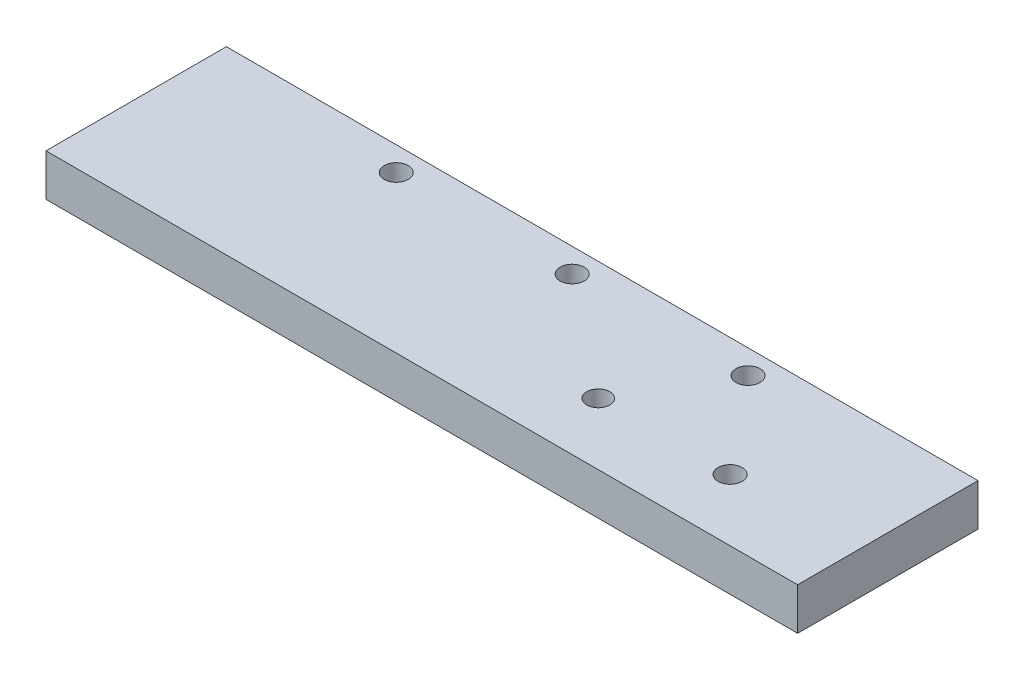
ISO-10303-21;
HEADER;
FILE_DESCRIPTION(('STEP AP214'),'2;1');
FILE_NAME('part.step','',(''),(''),'','','');
FILE_SCHEMA(('AUTOMOTIVE_DESIGN { 1 0 10303 214 1 1 1 1 }'));
ENDSEC;
DATA;
#1=APPLICATION_CONTEXT('core data for automotive mechanical design processes');
#2=APPLICATION_PROTOCOL_DEFINITION('international standard','automotive_design',2000,#1);
#3=PRODUCT_CONTEXT('',#1,'mechanical');
#4=PRODUCT('Part','Part','',(#3));
#5=PRODUCT_RELATED_PRODUCT_CATEGORY('part','',(#4));
#6=PRODUCT_DEFINITION_FORMATION('','',#4);
#7=PRODUCT_DEFINITION_CONTEXT('part definition',#1,'design');
#8=PRODUCT_DEFINITION('design','',#6,#7);
#9=PRODUCT_DEFINITION_SHAPE('','',#8);
#10=(LENGTH_UNIT() NAMED_UNIT(*) SI_UNIT(.MILLI.,.METRE.));
#11=(NAMED_UNIT(*) PLANE_ANGLE_UNIT() SI_UNIT($,.RADIAN.));
#12=(NAMED_UNIT(*) SI_UNIT($,.STERADIAN.) SOLID_ANGLE_UNIT());
#13=UNCERTAINTY_MEASURE_WITH_UNIT(LENGTH_MEASURE(1.E-05),#10,'distance_accuracy_value','');
#14=(GEOMETRIC_REPRESENTATION_CONTEXT(3) GLOBAL_UNCERTAINTY_ASSIGNED_CONTEXT((#13)) GLOBAL_UNIT_ASSIGNED_CONTEXT((#10,
#11,#12)) REPRESENTATION_CONTEXT('',''));
#15=CARTESIAN_POINT('',(0.,0.,0.));
#16=DIRECTION('',(0.,0.,1.));
#17=DIRECTION('',(1.,0.,0.));
#18=AXIS2_PLACEMENT_3D('',#15,#16,#17);
#19=CARTESIAN_POINT('',(-102.510460251046,7.,-65.1673640167364));
#20=DIRECTION('',(0.,0.,-1.));
#21=DIRECTION('',(-1.,0.,0.));
#22=AXIS2_PLACEMENT_3D('',#19,#20,#21);
#23=PLANE('',#22);
#24=DIRECTION('',(1.,0.,0.));
#25=VECTOR('',#24,1.);
#26=CARTESIAN_POINT('',(-102.510460251046,0.,-65.1673640167364));
#27=LINE('',#26,#25);
#28=CARTESIAN_POINT('',(-102.510460251046,0.,-65.1673640167364));
#29=VERTEX_POINT('',#28);
#30=CARTESIAN_POINT('',(22.4895397489539,0.,-65.1673640167364));
#31=VERTEX_POINT('',#30);
#32=EDGE_CURVE('E99',#29,#31,#27,.T.);
#33=ORIENTED_EDGE('',*,*,#32,.F.);
#34=DIRECTION('',(0.,-1.,0.));
#35=VECTOR('',#34,1.);
#36=CARTESIAN_POINT('',(-102.510460251046,7.,-65.1673640167364));
#37=LINE('',#36,#35);
#38=CARTESIAN_POINT('',(-102.510460251046,7.,-65.1673640167364));
#39=VERTEX_POINT('',#38);
#40=EDGE_CURVE('E11',#39,#29,#37,.T.);
#41=ORIENTED_EDGE('',*,*,#40,.F.);
#42=DIRECTION('',(1.,0.,0.));
#43=VECTOR('',#42,1.);
#44=CARTESIAN_POINT('',(-102.510460251046,7.,-65.1673640167364));
#45=LINE('',#44,#43);
#46=CARTESIAN_POINT('',(22.4895397489539,7.,-65.1673640167364));
#47=VERTEX_POINT('',#46);
#48=EDGE_CURVE('E93',#39,#47,#45,.T.);
#49=ORIENTED_EDGE('',*,*,#48,.T.);
#50=DIRECTION('',(0.,-1.,0.));
#51=VECTOR('',#50,1.);
#52=CARTESIAN_POINT('',(22.4895397489539,7.,-65.1673640167364));
#53=LINE('',#52,#51);
#54=EDGE_CURVE('E36',#47,#31,#53,.T.);
#55=ORIENTED_EDGE('',*,*,#54,.T.);
#56=EDGE_LOOP('',(#33,#41,#49,#55));
#57=FACE_BOUND('',#56,.T.);
#58=ADVANCED_FACE('F33',(#57),#23,.T.);
#59=CARTESIAN_POINT('',(-102.510460251046,7.,-65.1673640167364));
#60=DIRECTION('',(1.,0.,0.));
#61=DIRECTION('',(0.,0.,-1.));
#62=AXIS2_PLACEMENT_3D('',#59,#60,#61);
#63=PLANE('',#62);
#64=DIRECTION('',(0.,0.,1.));
#65=VECTOR('',#64,1.);
#66=CARTESIAN_POINT('',(-102.510460251046,0.,-65.1673640167364));
#67=LINE('',#66,#65);
#68=CARTESIAN_POINT('',(-102.510460251046,0.,-35.1673640167364));
#69=VERTEX_POINT('',#68);
#70=EDGE_CURVE('E66',#29,#69,#67,.T.);
#71=ORIENTED_EDGE('',*,*,#70,.T.);
#72=DIRECTION('',(0.,-1.,0.));
#73=VECTOR('',#72,1.);
#74=CARTESIAN_POINT('',(-102.510460251046,7.,-35.1673640167364));
#75=LINE('',#74,#73);
#76=CARTESIAN_POINT('',(-102.510460251046,7.,-35.1673640167364));
#77=VERTEX_POINT('',#76);
#78=EDGE_CURVE('E42',#77,#69,#75,.T.);
#79=ORIENTED_EDGE('',*,*,#78,.F.);
#80=DIRECTION('',(0.,0.,1.));
#81=VECTOR('',#80,1.);
#82=CARTESIAN_POINT('',(-102.510460251046,7.,-65.1673640167364));
#83=LINE('',#82,#81);
#84=EDGE_CURVE('E83',#39,#77,#83,.T.);
#85=ORIENTED_EDGE('',*,*,#84,.F.);
#86=ORIENTED_EDGE('',*,*,#40,.T.);
#87=EDGE_LOOP('',(#71,#79,#85,#86));
#88=FACE_BOUND('',#87,.T.);
#89=ADVANCED_FACE('F110',(#88),#63,.F.);
#90=CARTESIAN_POINT('',(-102.510460251046,7.,-35.1673640167364));
#91=DIRECTION('',(0.,0.,-1.));
#92=DIRECTION('',(-1.,0.,0.));
#93=AXIS2_PLACEMENT_3D('',#90,#91,#92);
#94=PLANE('',#93);
#95=DIRECTION('',(1.,0.,0.));
#96=VECTOR('',#95,1.);
#97=CARTESIAN_POINT('',(-102.510460251046,0.,-35.1673640167364));
#98=LINE('',#97,#96);
#99=CARTESIAN_POINT('',(22.4895397489539,0.,-35.1673640167364));
#100=VERTEX_POINT('',#99);
#101=EDGE_CURVE('E90',#69,#100,#98,.T.);
#102=ORIENTED_EDGE('',*,*,#101,.T.);
#103=DIRECTION('',(0.,-1.,0.));
#104=VECTOR('',#103,1.);
#105=CARTESIAN_POINT('',(22.4895397489539,7.,-35.1673640167364));
#106=LINE('',#105,#104);
#107=CARTESIAN_POINT('',(22.4895397489539,7.,-35.1673640167364));
#108=VERTEX_POINT('',#107);
#109=EDGE_CURVE('E87',#108,#100,#106,.T.);
#110=ORIENTED_EDGE('',*,*,#109,.F.);
#111=DIRECTION('',(1.,0.,0.));
#112=VECTOR('',#111,1.);
#113=CARTESIAN_POINT('',(-102.510460251046,7.,-35.1673640167364));
#114=LINE('',#113,#112);
#115=EDGE_CURVE('E78',#77,#108,#114,.T.);
#116=ORIENTED_EDGE('',*,*,#115,.F.);
#117=ORIENTED_EDGE('',*,*,#78,.T.);
#118=EDGE_LOOP('',(#102,#110,#116,#117));
#119=FACE_BOUND('',#118,.T.);
#120=ADVANCED_FACE('F88',(#119),#94,.F.);
#121=CARTESIAN_POINT('',(22.4895397489539,7.,-65.1673640167364));
#122=DIRECTION('',(1.,0.,0.));
#123=DIRECTION('',(0.,0.,-1.));
#124=AXIS2_PLACEMENT_3D('',#121,#122,#123);
#125=PLANE('',#124);
#126=DIRECTION('',(0.,0.,1.));
#127=VECTOR('',#126,1.);
#128=CARTESIAN_POINT('',(22.4895397489539,0.,-65.1673640167364));
#129=LINE('',#128,#127);
#130=EDGE_CURVE('E102',#31,#100,#129,.T.);
#131=ORIENTED_EDGE('',*,*,#130,.F.);
#132=ORIENTED_EDGE('',*,*,#54,.F.);
#133=DIRECTION('',(0.,0.,1.));
#134=VECTOR('',#133,1.);
#135=CARTESIAN_POINT('',(22.4895397489539,7.,-65.1673640167364));
#136=LINE('',#135,#134);
#137=EDGE_CURVE('E82',#47,#108,#136,.T.);
#138=ORIENTED_EDGE('',*,*,#137,.T.);
#139=ORIENTED_EDGE('',*,*,#109,.T.);
#140=EDGE_LOOP('',(#131,#132,#138,#139));
#141=FACE_BOUND('',#140,.T.);
#142=ADVANCED_FACE('F92',(#141),#125,.T.);
#143=CARTESIAN_POINT('',(0.,7.,0.));
#144=DIRECTION('',(0.,-1.,0.));
#145=DIRECTION('',(0.,0.,-1.));
#146=AXIS2_PLACEMENT_3D('',#143,#144,#145);
#147=PLANE('',#146);
#148=CARTESIAN_POINT('',(-70.2604602510461,7.,-61.1673640167364));
#149=DIRECTION('',(0.,-1.,0.));
#150=DIRECTION('',(0.,0.,-1.));
#151=AXIS2_PLACEMENT_3D('',#148,#149,#150);
#152=CIRCLE('',#151,2.);
#153=CARTESIAN_POINT('',(-70.2604602510461,7.,-63.1673640167364));
#154=VERTEX_POINT('',#153);
#155=EDGE_CURVE('E103',#154,#154,#152,.T.);
#156=ORIENTED_EDGE('',*,*,#155,.T.);
#157=EDGE_LOOP('',(#156));
#158=FACE_BOUND('',#157,.T.);
#159=CARTESIAN_POINT('',(-41.0104602510461,7.,-61.1673640167364));
#160=DIRECTION('',(0.,-1.,0.));
#161=DIRECTION('',(0.,0.,-1.));
#162=AXIS2_PLACEMENT_3D('',#159,#160,#161);
#163=CIRCLE('',#162,2.);
#164=CARTESIAN_POINT('',(-41.0104602510461,7.,-63.1673640167364));
#165=VERTEX_POINT('',#164);
#166=EDGE_CURVE('E159',#165,#165,#163,.T.);
#167=ORIENTED_EDGE('',*,*,#166,.T.);
#168=EDGE_LOOP('',(#167));
#169=FACE_BOUND('',#168,.T.);
#170=CARTESIAN_POINT('',(-11.7604602510461,7.,-61.1673640167364));
#171=DIRECTION('',(0.,-1.,0.));
#172=DIRECTION('',(0.,0.,-1.));
#173=AXIS2_PLACEMENT_3D('',#170,#171,#172);
#174=CIRCLE('',#173,2.00000000000001);
#175=CARTESIAN_POINT('',(-11.7604602510461,7.,-63.1673640167364));
#176=VERTEX_POINT('',#175);
#177=EDGE_CURVE('E161',#176,#176,#174,.T.);
#178=ORIENTED_EDGE('',*,*,#177,.T.);
#179=EDGE_LOOP('',(#178));
#180=FACE_BOUND('',#179,.T.);
#181=CARTESIAN_POINT('',(-20.9296837814463,7.,-45.4353956948097));
#182=DIRECTION('',(0.,-1.,0.));
#183=DIRECTION('',(0.,0.,-1.));
#184=AXIS2_PLACEMENT_3D('',#181,#182,#183);
#185=CIRCLE('',#184,1.91901681708569);
#186=CARTESIAN_POINT('',(-20.9296837814463,7.,-47.3544125118954));
#187=VERTEX_POINT('',#186);
#188=EDGE_CURVE('E166',#187,#187,#185,.T.);
#189=ORIENTED_EDGE('',*,*,#188,.T.);
#190=EDGE_LOOP('',(#189));
#191=FACE_BOUND('',#190,.T.);
#192=CARTESIAN_POINT('',(0.988735890301129,7.,-45.4353956948097));
#193=DIRECTION('',(0.,-1.,0.));
#194=DIRECTION('',(0.,0.,-1.));
#195=AXIS2_PLACEMENT_3D('',#192,#193,#194);
#196=CIRCLE('',#195,2.00548638503668);
#197=CARTESIAN_POINT('',(0.988735890301129,7.,-47.4408820798464));
#198=VERTEX_POINT('',#197);
#199=EDGE_CURVE('E169',#198,#198,#196,.T.);
#200=ORIENTED_EDGE('',*,*,#199,.T.);
#201=EDGE_LOOP('',(#200));
#202=FACE_BOUND('',#201,.T.);
#203=ORIENTED_EDGE('',*,*,#48,.F.);
#204=ORIENTED_EDGE('',*,*,#84,.T.);
#205=ORIENTED_EDGE('',*,*,#115,.T.);
#206=ORIENTED_EDGE('',*,*,#137,.F.);
#207=EDGE_LOOP('',(#203,#204,#205,#206));
#208=FACE_BOUND('',#207,.T.);
#209=ADVANCED_FACE('F81',(#158,#169,#180,#191,#202,#208),#147,.F.);
#210=CARTESIAN_POINT('',(0.,0.,0.));
#211=DIRECTION('',(0.,-1.,0.));
#212=DIRECTION('',(0.,0.,-1.));
#213=AXIS2_PLACEMENT_3D('',#210,#211,#212);
#214=PLANE('',#213);
#215=CARTESIAN_POINT('',(-70.2604602510461,0.,-61.1673640167364));
#216=DIRECTION('',(0.,-1.,0.));
#217=DIRECTION('',(0.,0.,-1.));
#218=AXIS2_PLACEMENT_3D('',#215,#216,#217);
#219=CIRCLE('',#218,2.);
#220=CARTESIAN_POINT('',(-70.2604602510461,0.,-63.1673640167364));
#221=VERTEX_POINT('',#220);
#222=EDGE_CURVE('E157',#221,#221,#219,.T.);
#223=ORIENTED_EDGE('',*,*,#222,.F.);
#224=EDGE_LOOP('',(#223));
#225=FACE_BOUND('',#224,.T.);
#226=CARTESIAN_POINT('',(-41.0104602510461,0.,-61.1673640167364));
#227=DIRECTION('',(0.,-1.,0.));
#228=DIRECTION('',(0.,0.,-1.));
#229=AXIS2_PLACEMENT_3D('',#226,#227,#228);
#230=CIRCLE('',#229,2.);
#231=CARTESIAN_POINT('',(-41.0104602510461,0.,-63.1673640167364));
#232=VERTEX_POINT('',#231);
#233=EDGE_CURVE('E181',#232,#232,#230,.T.);
#234=ORIENTED_EDGE('',*,*,#233,.F.);
#235=EDGE_LOOP('',(#234));
#236=FACE_BOUND('',#235,.T.);
#237=CARTESIAN_POINT('',(-11.7604602510461,0.,-61.1673640167364));
#238=DIRECTION('',(0.,-1.,0.));
#239=DIRECTION('',(0.,0.,-1.));
#240=AXIS2_PLACEMENT_3D('',#237,#238,#239);
#241=CIRCLE('',#240,2.00000000000001);
#242=CARTESIAN_POINT('',(-11.7604602510461,0.,-63.1673640167364));
#243=VERTEX_POINT('',#242);
#244=EDGE_CURVE('E178',#243,#243,#241,.T.);
#245=ORIENTED_EDGE('',*,*,#244,.F.);
#246=EDGE_LOOP('',(#245));
#247=FACE_BOUND('',#246,.T.);
#248=CARTESIAN_POINT('',(-20.9296837814463,0.,-45.4353956948097));
#249=DIRECTION('',(0.,-1.,0.));
#250=DIRECTION('',(0.,0.,-1.));
#251=AXIS2_PLACEMENT_3D('',#248,#249,#250);
#252=CIRCLE('',#251,1.91901681708569);
#253=CARTESIAN_POINT('',(-20.9296837814463,0.,-47.3544125118954));
#254=VERTEX_POINT('',#253);
#255=EDGE_CURVE('E175',#254,#254,#252,.T.);
#256=ORIENTED_EDGE('',*,*,#255,.F.);
#257=EDGE_LOOP('',(#256));
#258=FACE_BOUND('',#257,.T.);
#259=CARTESIAN_POINT('',(0.988735890301129,0.,-45.4353956948097));
#260=DIRECTION('',(0.,-1.,0.));
#261=DIRECTION('',(0.,0.,-1.));
#262=AXIS2_PLACEMENT_3D('',#259,#260,#261);
#263=CIRCLE('',#262,2.00548638503668);
#264=CARTESIAN_POINT('',(0.988735890301129,0.,-47.4408820798464));
#265=VERTEX_POINT('',#264);
#266=EDGE_CURVE('E172',#265,#265,#263,.T.);
#267=ORIENTED_EDGE('',*,*,#266,.F.);
#268=EDGE_LOOP('',(#267));
#269=FACE_BOUND('',#268,.T.);
#270=ORIENTED_EDGE('',*,*,#32,.T.);
#271=ORIENTED_EDGE('',*,*,#130,.T.);
#272=ORIENTED_EDGE('',*,*,#101,.F.);
#273=ORIENTED_EDGE('',*,*,#70,.F.);
#274=EDGE_LOOP('',(#270,#271,#272,#273));
#275=FACE_BOUND('',#274,.T.);
#276=ADVANCED_FACE('F108',(#225,#236,#247,#258,#269,#275),#214,.T.);
#277=CARTESIAN_POINT('',(0.988735890301129,10.,-45.4353956948097));
#278=DIRECTION('',(0.,-1.,0.));
#279=DIRECTION('',(0.,0.,-1.));
#280=AXIS2_PLACEMENT_3D('',#277,#278,#279);
#281=CYLINDRICAL_SURFACE('',#280,2.00548638503668);
#282=ORIENTED_EDGE('',*,*,#266,.T.);
#283=EDGE_LOOP('',(#282));
#284=FACE_BOUND('',#283,.T.);
#285=ORIENTED_EDGE('',*,*,#199,.F.);
#286=EDGE_LOOP('',(#285));
#287=FACE_BOUND('',#286,.T.);
#288=ADVANCED_FACE('F129',(#284,#287),#281,.F.);
#289=CARTESIAN_POINT('',(-20.9296837814463,10.,-45.4353956948097));
#290=DIRECTION('',(0.,-1.,0.));
#291=DIRECTION('',(0.,0.,-1.));
#292=AXIS2_PLACEMENT_3D('',#289,#290,#291);
#293=CYLINDRICAL_SURFACE('',#292,1.91901681708569);
#294=ORIENTED_EDGE('',*,*,#255,.T.);
#295=EDGE_LOOP('',(#294));
#296=FACE_BOUND('',#295,.T.);
#297=ORIENTED_EDGE('',*,*,#188,.F.);
#298=EDGE_LOOP('',(#297));
#299=FACE_BOUND('',#298,.T.);
#300=ADVANCED_FACE('F136',(#296,#299),#293,.F.);
#301=CARTESIAN_POINT('',(-11.7604602510461,10.,-61.1673640167364));
#302=DIRECTION('',(0.,-1.,0.));
#303=DIRECTION('',(0.,0.,-1.));
#304=AXIS2_PLACEMENT_3D('',#301,#302,#303);
#305=CYLINDRICAL_SURFACE('',#304,2.00000000000001);
#306=ORIENTED_EDGE('',*,*,#244,.T.);
#307=EDGE_LOOP('',(#306));
#308=FACE_BOUND('',#307,.T.);
#309=ORIENTED_EDGE('',*,*,#177,.F.);
#310=EDGE_LOOP('',(#309));
#311=FACE_BOUND('',#310,.T.);
#312=ADVANCED_FACE('F140',(#308,#311),#305,.F.);
#313=CARTESIAN_POINT('',(-41.0104602510461,10.,-61.1673640167364));
#314=DIRECTION('',(0.,-1.,0.));
#315=DIRECTION('',(0.,0.,-1.));
#316=AXIS2_PLACEMENT_3D('',#313,#314,#315);
#317=CYLINDRICAL_SURFACE('',#316,2.);
#318=ORIENTED_EDGE('',*,*,#233,.T.);
#319=EDGE_LOOP('',(#318));
#320=FACE_BOUND('',#319,.T.);
#321=ORIENTED_EDGE('',*,*,#166,.F.);
#322=EDGE_LOOP('',(#321));
#323=FACE_BOUND('',#322,.T.);
#324=ADVANCED_FACE('F144',(#320,#323),#317,.F.);
#325=CARTESIAN_POINT('',(-70.2604602510461,10.,-61.1673640167364));
#326=DIRECTION('',(0.,-1.,0.));
#327=DIRECTION('',(0.,0.,-1.));
#328=AXIS2_PLACEMENT_3D('',#325,#326,#327);
#329=CYLINDRICAL_SURFACE('',#328,2.);
#330=ORIENTED_EDGE('',*,*,#222,.T.);
#331=EDGE_LOOP('',(#330));
#332=FACE_BOUND('',#331,.T.);
#333=ORIENTED_EDGE('',*,*,#155,.F.);
#334=EDGE_LOOP('',(#333));
#335=FACE_BOUND('',#334,.T.);
#336=ADVANCED_FACE('F148',(#332,#335),#329,.F.);
#337=CLOSED_SHELL('',(#58,#89,#120,#142,#209,#276,#288,#300,#312,#324,#336));
#338=MANIFOLD_SOLID_BREP('B2',#337);
#339=ADVANCED_BREP_SHAPE_REPRESENTATION('',(#18,#338),#14);
#340=SHAPE_DEFINITION_REPRESENTATION(#9,#339);
ENDSEC;
END-ISO-10303-21;
